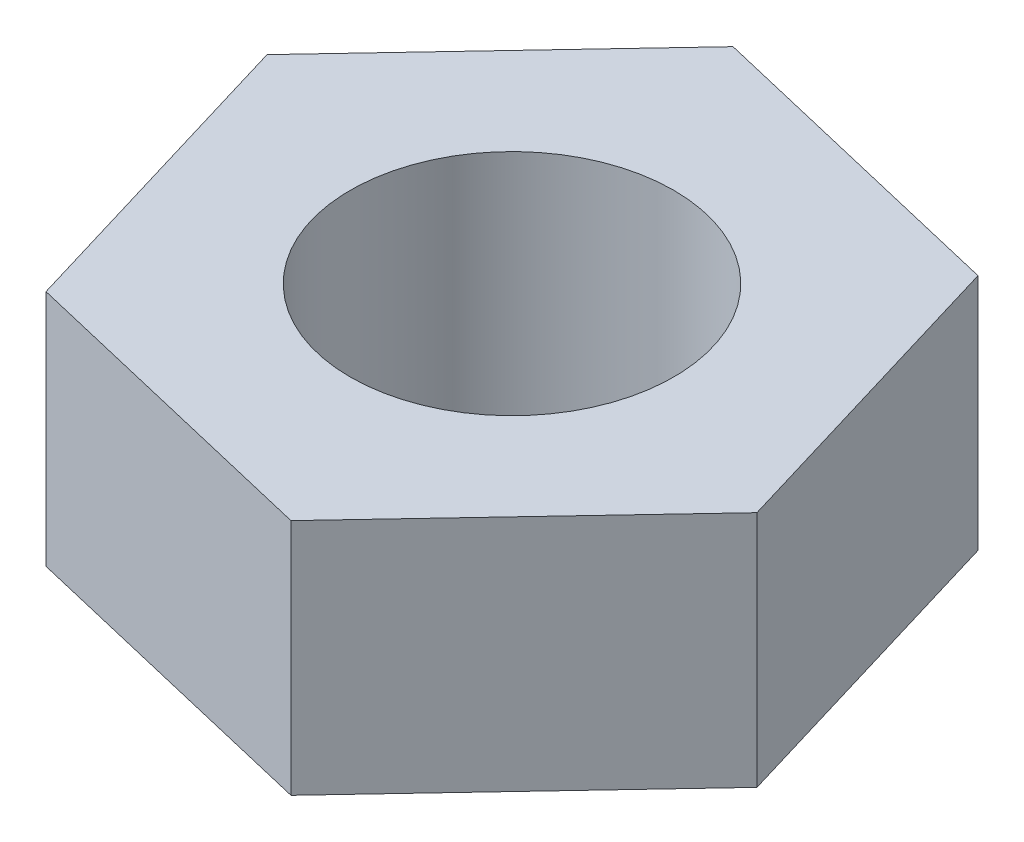
ISO-10303-21;
HEADER;
FILE_DESCRIPTION(('STEP AP214'),'2;1');
FILE_NAME('part.step','',(''),(''),'','','');
FILE_SCHEMA(('AUTOMOTIVE_DESIGN { 1 0 10303 214 1 1 1 1 }'));
ENDSEC;
DATA;
#1=APPLICATION_CONTEXT('core data for automotive mechanical design processes');
#2=APPLICATION_PROTOCOL_DEFINITION('international standard','automotive_design',2000,#1);
#3=PRODUCT_CONTEXT('',#1,'mechanical');
#4=PRODUCT('Part','Part','',(#3));
#5=PRODUCT_RELATED_PRODUCT_CATEGORY('part','',(#4));
#6=PRODUCT_DEFINITION_FORMATION('','',#4);
#7=PRODUCT_DEFINITION_CONTEXT('part definition',#1,'design');
#8=PRODUCT_DEFINITION('design','',#6,#7);
#9=PRODUCT_DEFINITION_SHAPE('','',#8);
#10=(LENGTH_UNIT() NAMED_UNIT(*) SI_UNIT(.MILLI.,.METRE.));
#11=(NAMED_UNIT(*) PLANE_ANGLE_UNIT() SI_UNIT($,.RADIAN.));
#12=(NAMED_UNIT(*) SI_UNIT($,.STERADIAN.) SOLID_ANGLE_UNIT());
#13=UNCERTAINTY_MEASURE_WITH_UNIT(LENGTH_MEASURE(1.E-05),#10,'distance_accuracy_value','');
#14=(GEOMETRIC_REPRESENTATION_CONTEXT(3) GLOBAL_UNCERTAINTY_ASSIGNED_CONTEXT((#13)) GLOBAL_UNIT_ASSIGNED_CONTEXT((#10,
#11,#12)) REPRESENTATION_CONTEXT('',''));
#15=CARTESIAN_POINT('',(0.,0.,0.));
#16=DIRECTION('',(0.,0.,1.));
#17=DIRECTION('',(1.,0.,0.));
#18=AXIS2_PLACEMENT_3D('',#15,#16,#17);
#19=CARTESIAN_POINT('',(-7.12733315524509,7.5,7.56314234258117));
#20=DIRECTION('',(0.230062573986366,0.,-0.973175838197172));
#21=DIRECTION('',(-0.973175838197172,0.,-0.230062573986366));
#22=AXIS2_PLACEMENT_3D('',#19,#20,#21);
#23=PLANE('',#22);
#24=DIRECTION('',(0.973175838197172,0.,0.230062573986366));
#25=VECTOR('',#24,1.);
#26=CARTESIAN_POINT('',(-7.12733315524509,0.,7.56314234258117));
#27=LINE('',#26,#25);
#28=CARTESIAN_POINT('',(-7.12733315524509,0.,7.56314234258117));
#29=VERTEX_POINT('',#28);
#30=CARTESIAN_POINT('',(2.9862068234905,0.,9.95402274496792));
#31=VERTEX_POINT('',#30);
#32=EDGE_CURVE('E117',#29,#31,#27,.T.);
#33=ORIENTED_EDGE('',*,*,#32,.T.);
#34=DIRECTION('',(0.,-1.,0.));
#35=VECTOR('',#34,1.);
#36=CARTESIAN_POINT('',(2.9862068234905,7.5,9.95402274496792));
#37=LINE('',#36,#35);
#38=CARTESIAN_POINT('',(2.9862068234905,7.5,9.95402274496792));
#39=VERTEX_POINT('',#38);
#40=EDGE_CURVE('E11',#39,#31,#37,.T.);
#41=ORIENTED_EDGE('',*,*,#40,.F.);
#42=DIRECTION('',(0.973175838197172,0.,0.230062573986366));
#43=VECTOR('',#42,1.);
#44=CARTESIAN_POINT('',(-7.12733315524509,7.5,7.56314234258117));
#45=LINE('',#44,#43);
#46=CARTESIAN_POINT('',(-7.12733315524509,7.5,7.56314234258117));
#47=VERTEX_POINT('',#46);
#48=EDGE_CURVE('E128',#47,#39,#45,.T.);
#49=ORIENTED_EDGE('',*,*,#48,.F.);
#50=DIRECTION('',(0.,-1.,0.));
#51=VECTOR('',#50,1.);
#52=CARTESIAN_POINT('',(-7.12733315524509,7.5,7.56314234258117));
#53=LINE('',#52,#51);
#54=EDGE_CURVE('E113',#47,#29,#53,.T.);
#55=ORIENTED_EDGE('',*,*,#54,.T.);
#56=EDGE_LOOP('',(#33,#41,#49,#55));
#57=FACE_BOUND('',#56,.T.);
#58=ADVANCED_FACE('F33',(#57),#23,.F.);
#59=CARTESIAN_POINT('',(2.9862068234905,7.5,9.95402274496792));
#60=DIRECTION('',(-0.727763711234783,0.,-0.685827952630815));
#61=DIRECTION('',(-0.685827952630815,0.,0.727763711234783));
#62=AXIS2_PLACEMENT_3D('',#59,#60,#61);
#63=PLANE('',#62);
#64=DIRECTION('',(0.685827952630815,0.,-0.727763711234783));
#65=VECTOR('',#64,1.);
#66=CARTESIAN_POINT('',(2.9862068234905,0.,9.95402274496792));
#67=LINE('',#66,#65);
#68=CARTESIAN_POINT('',(10.1135399787356,0.,2.39088040238675));
#69=VERTEX_POINT('',#68);
#70=EDGE_CURVE('E120',#31,#69,#67,.T.);
#71=ORIENTED_EDGE('',*,*,#70,.T.);
#72=DIRECTION('',(0.,-1.,0.));
#73=VECTOR('',#72,1.);
#74=CARTESIAN_POINT('',(10.1135399787356,7.5,2.39088040238675));
#75=LINE('',#74,#73);
#76=CARTESIAN_POINT('',(10.1135399787356,7.5,2.39088040238675));
#77=VERTEX_POINT('',#76);
#78=EDGE_CURVE('E41',#77,#69,#75,.T.);
#79=ORIENTED_EDGE('',*,*,#78,.F.);
#80=DIRECTION('',(0.685827952630815,0.,-0.727763711234783));
#81=VECTOR('',#80,1.);
#82=CARTESIAN_POINT('',(2.9862068234905,7.5,9.95402274496792));
#83=LINE('',#82,#81);
#84=EDGE_CURVE('E86',#39,#77,#83,.T.);
#85=ORIENTED_EDGE('',*,*,#84,.F.);
#86=ORIENTED_EDGE('',*,*,#40,.T.);
#87=EDGE_LOOP('',(#71,#79,#85,#86));
#88=FACE_BOUND('',#87,.T.);
#89=ADVANCED_FACE('F153',(#88),#63,.F.);
#90=CARTESIAN_POINT('',(10.1135399787356,7.5,2.39088040238675));
#91=DIRECTION('',(-0.957826285221148,0.,0.287347885566357));
#92=DIRECTION('',(0.287347885566357,0.,0.957826285221148));
#93=AXIS2_PLACEMENT_3D('',#90,#91,#92);
#94=PLANE('',#93);
#95=DIRECTION('',(-0.287347885566357,0.,-0.957826285221148));
#96=VECTOR('',#95,1.);
#97=CARTESIAN_POINT('',(10.1135399787356,0.,2.39088040238675));
#98=LINE('',#97,#96);
#99=CARTESIAN_POINT('',(7.12733315524508,0.,-7.56314234258117));
#100=VERTEX_POINT('',#99);
#101=EDGE_CURVE('E123',#69,#100,#98,.T.);
#102=ORIENTED_EDGE('',*,*,#101,.T.);
#103=DIRECTION('',(0.,-1.,0.));
#104=VECTOR('',#103,1.);
#105=CARTESIAN_POINT('',(7.12733315524508,7.5,-7.56314234258117));
#106=LINE('',#105,#104);
#107=CARTESIAN_POINT('',(7.12733315524508,7.5,-7.56314234258117));
#108=VERTEX_POINT('',#107);
#109=EDGE_CURVE('E108',#108,#100,#106,.T.);
#110=ORIENTED_EDGE('',*,*,#109,.F.);
#111=DIRECTION('',(-0.287347885566357,0.,-0.957826285221148));
#112=VECTOR('',#111,1.);
#113=CARTESIAN_POINT('',(10.1135399787356,7.5,2.39088040238675));
#114=LINE('',#113,#112);
#115=EDGE_CURVE('E99',#77,#108,#114,.T.);
#116=ORIENTED_EDGE('',*,*,#115,.F.);
#117=ORIENTED_EDGE('',*,*,#78,.T.);
#118=EDGE_LOOP('',(#102,#110,#116,#117));
#119=FACE_BOUND('',#118,.T.);
#120=ADVANCED_FACE('F134',(#119),#94,.F.);
#121=CARTESIAN_POINT('',(7.12733315524508,7.5,-7.56314234258117));
#122=DIRECTION('',(-0.230062573986366,0.,0.973175838197172));
#123=DIRECTION('',(0.973175838197172,0.,0.230062573986366));
#124=AXIS2_PLACEMENT_3D('',#121,#122,#123);
#125=PLANE('',#124);
#126=DIRECTION('',(-0.973175838197172,0.,-0.230062573986366));
#127=VECTOR('',#126,1.);
#128=CARTESIAN_POINT('',(7.12733315524508,0.,-7.56314234258117));
#129=LINE('',#128,#127);
#130=CARTESIAN_POINT('',(-2.9862068234905,0.,-9.95402274496793));
#131=VERTEX_POINT('',#130);
#132=EDGE_CURVE('E107',#100,#131,#129,.T.);
#133=ORIENTED_EDGE('',*,*,#132,.T.);
#134=DIRECTION('',(0.,-1.,0.));
#135=VECTOR('',#134,1.);
#136=CARTESIAN_POINT('',(-2.9862068234905,7.5,-9.95402274496793));
#137=LINE('',#136,#135);
#138=CARTESIAN_POINT('',(-2.9862068234905,7.5,-9.95402274496793));
#139=VERTEX_POINT('',#138);
#140=EDGE_CURVE('E104',#139,#131,#137,.T.);
#141=ORIENTED_EDGE('',*,*,#140,.F.);
#142=DIRECTION('',(-0.973175838197172,0.,-0.230062573986366));
#143=VECTOR('',#142,1.);
#144=CARTESIAN_POINT('',(7.12733315524508,7.5,-7.56314234258117));
#145=LINE('',#144,#143);
#146=EDGE_CURVE('E93',#108,#139,#145,.T.);
#147=ORIENTED_EDGE('',*,*,#146,.F.);
#148=ORIENTED_EDGE('',*,*,#109,.T.);
#149=EDGE_LOOP('',(#133,#141,#147,#148));
#150=FACE_BOUND('',#149,.T.);
#151=ADVANCED_FACE('F105',(#150),#125,.F.);
#152=CARTESIAN_POINT('',(-2.9862068234905,7.5,-9.95402274496793));
#153=DIRECTION('',(0.727763711234783,0.,0.685827952630815));
#154=DIRECTION('',(0.685827952630815,0.,-0.727763711234783));
#155=AXIS2_PLACEMENT_3D('',#152,#153,#154);
#156=PLANE('',#155);
#157=DIRECTION('',(-0.685827952630815,0.,0.727763711234783));
#158=VECTOR('',#157,1.);
#159=CARTESIAN_POINT('',(-2.9862068234905,0.,-9.95402274496793));
#160=LINE('',#159,#158);
#161=CARTESIAN_POINT('',(-10.1135399787356,0.,-2.39088040238676));
#162=VERTEX_POINT('',#161);
#163=EDGE_CURVE('E72',#131,#162,#160,.T.);
#164=ORIENTED_EDGE('',*,*,#163,.T.);
#165=DIRECTION('',(0.,-1.,0.));
#166=VECTOR('',#165,1.);
#167=CARTESIAN_POINT('',(-10.1135399787356,7.5,-2.39088040238676));
#168=LINE('',#167,#166);
#169=CARTESIAN_POINT('',(-10.1135399787356,7.5,-2.39088040238676));
#170=VERTEX_POINT('',#169);
#171=EDGE_CURVE('E109',#170,#162,#168,.T.);
#172=ORIENTED_EDGE('',*,*,#171,.F.);
#173=DIRECTION('',(-0.685827952630815,0.,0.727763711234783));
#174=VECTOR('',#173,1.);
#175=CARTESIAN_POINT('',(-2.9862068234905,7.5,-9.95402274496793));
#176=LINE('',#175,#174);
#177=EDGE_CURVE('E97',#139,#170,#176,.T.);
#178=ORIENTED_EDGE('',*,*,#177,.F.);
#179=ORIENTED_EDGE('',*,*,#140,.T.);
#180=EDGE_LOOP('',(#164,#172,#178,#179));
#181=FACE_BOUND('',#180,.T.);
#182=ADVANCED_FACE('F111',(#181),#156,.F.);
#183=CARTESIAN_POINT('',(-10.1135399787356,7.5,-2.39088040238676));
#184=DIRECTION('',(0.957826285221148,0.,-0.287347885566356));
#185=DIRECTION('',(-0.287347885566356,0.,-0.957826285221148));
#186=AXIS2_PLACEMENT_3D('',#183,#184,#185);
#187=PLANE('',#186);
#188=DIRECTION('',(0.287347885566356,0.,0.957826285221148));
#189=VECTOR('',#188,1.);
#190=CARTESIAN_POINT('',(-10.1135399787356,0.,-2.39088040238676));
#191=LINE('',#190,#189);
#192=EDGE_CURVE('E78',#162,#29,#191,.T.);
#193=ORIENTED_EDGE('',*,*,#192,.T.);
#194=ORIENTED_EDGE('',*,*,#54,.F.);
#195=DIRECTION('',(0.287347885566356,0.,0.957826285221148));
#196=VECTOR('',#195,1.);
#197=CARTESIAN_POINT('',(-10.1135399787356,7.5,-2.39088040238676));
#198=LINE('',#197,#196);
#199=EDGE_CURVE('E49',#170,#47,#198,.T.);
#200=ORIENTED_EDGE('',*,*,#199,.F.);
#201=ORIENTED_EDGE('',*,*,#171,.T.);
#202=EDGE_LOOP('',(#193,#194,#200,#201));
#203=FACE_BOUND('',#202,.T.);
#204=ADVANCED_FACE('F141',(#203),#187,.F.);
#205=CARTESIAN_POINT('',(2.9862068234905,7.5,9.95402274496792));
#206=DIRECTION('',(0.,1.,0.));
#207=DIRECTION('',(0.,0.,1.));
#208=AXIS2_PLACEMENT_3D('',#205,#206,#207);
#209=PLANE('',#208);
#210=CARTESIAN_POINT('',(0.,7.5,0.));
#211=DIRECTION('',(0.,1.,0.));
#212=DIRECTION('',(0.,0.,1.));
#213=AXIS2_PLACEMENT_3D('',#210,#211,#212);
#214=CIRCLE('',#213,5.09999999999999);
#215=CARTESIAN_POINT('',(0.,7.5,5.09999999999999));
#216=VERTEX_POINT('',#215);
#217=EDGE_CURVE('E121',#216,#216,#214,.T.);
#218=ORIENTED_EDGE('',*,*,#217,.F.);
#219=EDGE_LOOP('',(#218));
#220=FACE_BOUND('',#219,.T.);
#221=ORIENTED_EDGE('',*,*,#48,.T.);
#222=ORIENTED_EDGE('',*,*,#84,.T.);
#223=ORIENTED_EDGE('',*,*,#115,.T.);
#224=ORIENTED_EDGE('',*,*,#146,.T.);
#225=ORIENTED_EDGE('',*,*,#177,.T.);
#226=ORIENTED_EDGE('',*,*,#199,.T.);
#227=EDGE_LOOP('',(#221,#222,#223,#224,#225,#226));
#228=FACE_BOUND('',#227,.T.);
#229=ADVANCED_FACE('F95',(#220,#228),#209,.T.);
#230=CARTESIAN_POINT('',(2.9862068234905,0.,9.95402274496792));
#231=DIRECTION('',(0.,1.,0.));
#232=DIRECTION('',(0.,0.,1.));
#233=AXIS2_PLACEMENT_3D('',#230,#231,#232);
#234=PLANE('',#233);
#235=CARTESIAN_POINT('',(0.,0.,0.));
#236=DIRECTION('',(0.,-1.,0.));
#237=DIRECTION('',(0.,0.,-1.));
#238=AXIS2_PLACEMENT_3D('',#235,#236,#237);
#239=CIRCLE('',#238,5.09999999999999);
#240=CARTESIAN_POINT('',(0.,0.,-5.09999999999999));
#241=VERTEX_POINT('',#240);
#242=EDGE_CURVE('E208',#241,#241,#239,.T.);
#243=ORIENTED_EDGE('',*,*,#242,.F.);
#244=EDGE_LOOP('',(#243));
#245=FACE_BOUND('',#244,.T.);
#246=ORIENTED_EDGE('',*,*,#32,.F.);
#247=ORIENTED_EDGE('',*,*,#192,.F.);
#248=ORIENTED_EDGE('',*,*,#163,.F.);
#249=ORIENTED_EDGE('',*,*,#132,.F.);
#250=ORIENTED_EDGE('',*,*,#101,.F.);
#251=ORIENTED_EDGE('',*,*,#70,.F.);
#252=EDGE_LOOP('',(#246,#247,#248,#249,#250,#251));
#253=FACE_BOUND('',#252,.T.);
#254=ADVANCED_FACE('F137',(#245,#253),#234,.F.);
#255=CARTESIAN_POINT('',(0.,0.,0.));
#256=DIRECTION('',(0.,-1.,0.));
#257=DIRECTION('',(0.,0.,-1.));
#258=AXIS2_PLACEMENT_3D('',#255,#256,#257);
#259=CYLINDRICAL_SURFACE('',#258,5.09999999999999);
#260=ORIENTED_EDGE('',*,*,#217,.T.);
#261=EDGE_LOOP('',(#260));
#262=FACE_BOUND('',#261,.T.);
#263=ORIENTED_EDGE('',*,*,#242,.T.);
#264=EDGE_LOOP('',(#263));
#265=FACE_BOUND('',#264,.T.);
#266=ADVANCED_FACE('F190',(#262,#265),#259,.F.);
#267=CLOSED_SHELL('',(#58,#89,#120,#151,#182,#204,#229,#254,#266));
#268=MANIFOLD_SOLID_BREP('B2',#267);
#269=ADVANCED_BREP_SHAPE_REPRESENTATION('',(#18,#268),#14);
#270=SHAPE_DEFINITION_REPRESENTATION(#9,#269);
ENDSEC;
END-ISO-10303-21;
